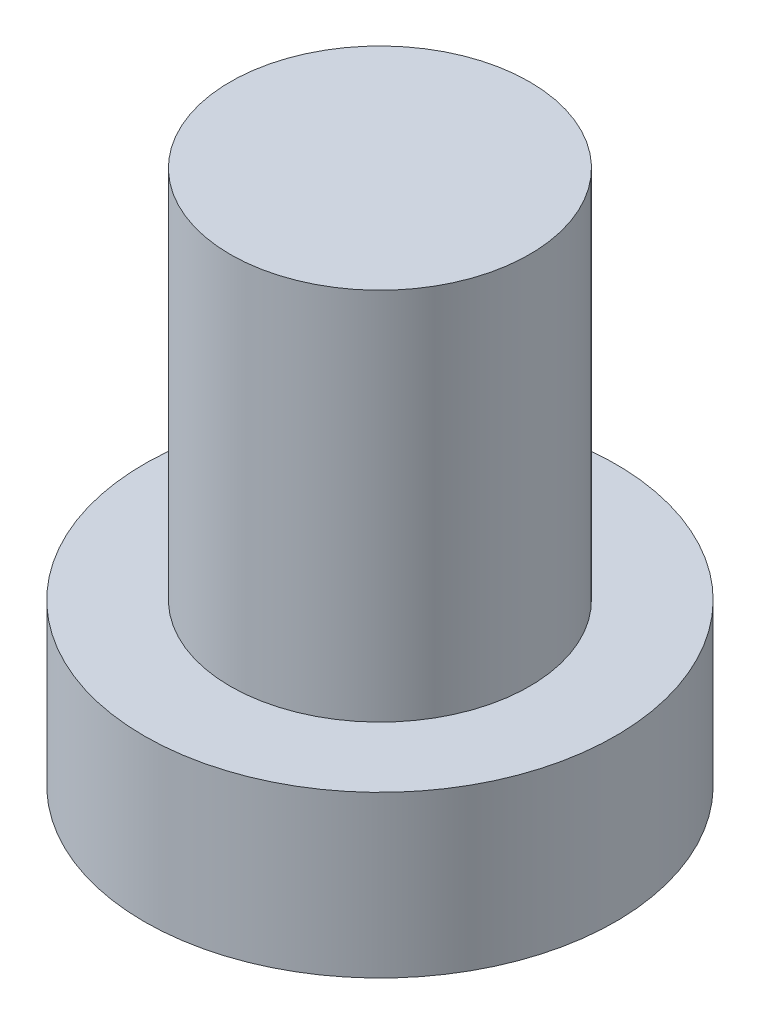
ISO-10303-21;
HEADER;
FILE_DESCRIPTION(('STEP AP214'),'2;1');
FILE_NAME('part.step','',(''),(''),'','','');
FILE_SCHEMA(('AUTOMOTIVE_DESIGN { 1 0 10303 214 1 1 1 1 }'));
ENDSEC;
DATA;
#1=APPLICATION_CONTEXT('core data for automotive mechanical design processes');
#2=APPLICATION_PROTOCOL_DEFINITION('international standard','automotive_design',2000,#1);
#3=PRODUCT_CONTEXT('',#1,'mechanical');
#4=PRODUCT('Part','Part','',(#3));
#5=PRODUCT_RELATED_PRODUCT_CATEGORY('part','',(#4));
#6=PRODUCT_DEFINITION_FORMATION('','',#4);
#7=PRODUCT_DEFINITION_CONTEXT('part definition',#1,'design');
#8=PRODUCT_DEFINITION('design','',#6,#7);
#9=PRODUCT_DEFINITION_SHAPE('','',#8);
#10=(LENGTH_UNIT() NAMED_UNIT(*) SI_UNIT(.MILLI.,.METRE.));
#11=(NAMED_UNIT(*) PLANE_ANGLE_UNIT() SI_UNIT($,.RADIAN.));
#12=(NAMED_UNIT(*) SI_UNIT($,.STERADIAN.) SOLID_ANGLE_UNIT());
#13=UNCERTAINTY_MEASURE_WITH_UNIT(LENGTH_MEASURE(1.E-05),#10,'distance_accuracy_value','');
#14=(GEOMETRIC_REPRESENTATION_CONTEXT(3) GLOBAL_UNCERTAINTY_ASSIGNED_CONTEXT((#13)) GLOBAL_UNIT_ASSIGNED_CONTEXT((#10,
#11,#12)) REPRESENTATION_CONTEXT('',''));
#15=CARTESIAN_POINT('',(0.,0.,0.));
#16=DIRECTION('',(0.,0.,1.));
#17=DIRECTION('',(1.,0.,0.));
#18=AXIS2_PLACEMENT_3D('',#15,#16,#17);
#19=CARTESIAN_POINT('',(0.,0.,0.));
#20=DIRECTION('',(0.,1.,0.));
#21=DIRECTION('',(0.,0.,1.));
#22=AXIS2_PLACEMENT_3D('',#19,#20,#21);
#23=PLANE('',#22);
#24=CARTESIAN_POINT('',(0.,0.,0.));
#25=DIRECTION('',(0.,1.,0.));
#26=DIRECTION('',(0.,0.,1.));
#27=AXIS2_PLACEMENT_3D('',#24,#25,#26);
#28=CIRCLE('',#27,3.15);
#29=CARTESIAN_POINT('',(0.,0.,3.15));
#30=VERTEX_POINT('',#29);
#31=EDGE_CURVE('E39',#30,#30,#28,.T.);
#32=ORIENTED_EDGE('',*,*,#31,.F.);
#33=EDGE_LOOP('',(#32));
#34=FACE_BOUND('',#33,.T.);
#35=CARTESIAN_POINT('',(1.,0.,1.));
#36=DIRECTION('',(0.,1.,0.));
#37=DIRECTION('',(0.,0.,-1.));
#38=AXIS2_PLACEMENT_3D('',#35,#36,#37);
#39=CIRCLE('',#38,0.5);
#40=CARTESIAN_POINT('',(1.,0.,0.5));
#41=VERTEX_POINT('',#40);
#42=CARTESIAN_POINT('',(0.5,0.,1.));
#43=VERTEX_POINT('',#42);
#44=EDGE_CURVE('E186',#41,#43,#39,.T.);
#45=ORIENTED_EDGE('',*,*,#44,.F.);
#46=DIRECTION('',(-1.,0.,0.));
#47=VECTOR('',#46,1.);
#48=CARTESIAN_POINT('',(1.,0.,0.5));
#49=LINE('',#48,#47);
#50=CARTESIAN_POINT('',(2.,0.,0.5));
#51=VERTEX_POINT('',#50);
#52=EDGE_CURVE('E52',#51,#41,#49,.T.);
#53=ORIENTED_EDGE('',*,*,#52,.F.);
#54=DIRECTION('',(0.,0.,1.));
#55=VECTOR('',#54,1.);
#56=CARTESIAN_POINT('',(2.,0.,-0.5));
#57=LINE('',#56,#55);
#58=CARTESIAN_POINT('',(2.,0.,-0.5));
#59=VERTEX_POINT('',#58);
#60=EDGE_CURVE('E225',#59,#51,#57,.T.);
#61=ORIENTED_EDGE('',*,*,#60,.F.);
#62=DIRECTION('',(1.,0.,0.));
#63=VECTOR('',#62,1.);
#64=CARTESIAN_POINT('',(1.,0.,-0.5));
#65=LINE('',#64,#63);
#66=CARTESIAN_POINT('',(1.,0.,-0.5));
#67=VERTEX_POINT('',#66);
#68=EDGE_CURVE('E223',#67,#59,#65,.T.);
#69=ORIENTED_EDGE('',*,*,#68,.F.);
#70=CARTESIAN_POINT('',(1.,0.,-1.));
#71=DIRECTION('',(0.,1.,0.));
#72=DIRECTION('',(0.,0.,-1.));
#73=AXIS2_PLACEMENT_3D('',#70,#71,#72);
#74=CIRCLE('',#73,0.5);
#75=CARTESIAN_POINT('',(0.500000000000001,0.,-1.));
#76=VERTEX_POINT('',#75);
#77=EDGE_CURVE('E160',#76,#67,#74,.T.);
#78=ORIENTED_EDGE('',*,*,#77,.F.);
#79=DIRECTION('',(0.,0.,1.));
#80=VECTOR('',#79,1.);
#81=CARTESIAN_POINT('',(0.500000000000001,0.,-2.));
#82=LINE('',#81,#80);
#83=CARTESIAN_POINT('',(0.500000000000001,0.,-2.));
#84=VERTEX_POINT('',#83);
#85=EDGE_CURVE('E219',#84,#76,#82,.T.);
#86=ORIENTED_EDGE('',*,*,#85,.F.);
#87=DIRECTION('',(1.,0.,0.));
#88=VECTOR('',#87,1.);
#89=CARTESIAN_POINT('',(-0.5,0.,-2.));
#90=LINE('',#89,#88);
#91=CARTESIAN_POINT('',(-0.5,0.,-2.));
#92=VERTEX_POINT('',#91);
#93=EDGE_CURVE('E216',#92,#84,#90,.T.);
#94=ORIENTED_EDGE('',*,*,#93,.F.);
#95=DIRECTION('',(0.,0.,-1.));
#96=VECTOR('',#95,1.);
#97=CARTESIAN_POINT('',(-0.5,0.,-2.));
#98=LINE('',#97,#96);
#99=CARTESIAN_POINT('',(-0.5,0.,-1.));
#100=VERTEX_POINT('',#99);
#101=EDGE_CURVE('E213',#100,#92,#98,.T.);
#102=ORIENTED_EDGE('',*,*,#101,.F.);
#103=CARTESIAN_POINT('',(-1.,0.,-1.));
#104=DIRECTION('',(0.,1.,0.));
#105=DIRECTION('',(0.,0.,-1.));
#106=AXIS2_PLACEMENT_3D('',#103,#104,#105);
#107=CIRCLE('',#106,0.5);
#108=CARTESIAN_POINT('',(-1.,0.,-0.5));
#109=VERTEX_POINT('',#108);
#110=EDGE_CURVE('E210',#109,#100,#107,.T.);
#111=ORIENTED_EDGE('',*,*,#110,.F.);
#112=DIRECTION('',(1.,0.,0.));
#113=VECTOR('',#112,1.);
#114=CARTESIAN_POINT('',(-2.,0.,-0.5));
#115=LINE('',#114,#113);
#116=CARTESIAN_POINT('',(-2.,0.,-0.5));
#117=VERTEX_POINT('',#116);
#118=EDGE_CURVE('E207',#117,#109,#115,.T.);
#119=ORIENTED_EDGE('',*,*,#118,.F.);
#120=DIRECTION('',(0.,0.,-1.));
#121=VECTOR('',#120,1.);
#122=CARTESIAN_POINT('',(-2.,0.,-0.5));
#123=LINE('',#122,#121);
#124=CARTESIAN_POINT('',(-2.,0.,0.5));
#125=VERTEX_POINT('',#124);
#126=EDGE_CURVE('E204',#125,#117,#123,.T.);
#127=ORIENTED_EDGE('',*,*,#126,.F.);
#128=DIRECTION('',(-1.,0.,0.));
#129=VECTOR('',#128,1.);
#130=CARTESIAN_POINT('',(-2.,0.,0.5));
#131=LINE('',#130,#129);
#132=CARTESIAN_POINT('',(-1.,0.,0.5));
#133=VERTEX_POINT('',#132);
#134=EDGE_CURVE('E201',#133,#125,#131,.T.);
#135=ORIENTED_EDGE('',*,*,#134,.F.);
#136=CARTESIAN_POINT('',(-1.,0.,1.));
#137=DIRECTION('',(0.,1.,0.));
#138=DIRECTION('',(0.,0.,1.));
#139=AXIS2_PLACEMENT_3D('',#136,#137,#138);
#140=CIRCLE('',#139,0.5);
#141=CARTESIAN_POINT('',(-0.5,0.,1.));
#142=VERTEX_POINT('',#141);
#143=EDGE_CURVE('E198',#142,#133,#140,.T.);
#144=ORIENTED_EDGE('',*,*,#143,.F.);
#145=DIRECTION('',(0.,0.,-1.));
#146=VECTOR('',#145,1.);
#147=CARTESIAN_POINT('',(-0.5,0.,1.));
#148=LINE('',#147,#146);
#149=CARTESIAN_POINT('',(-0.5,0.,2.));
#150=VERTEX_POINT('',#149);
#151=EDGE_CURVE('E195',#150,#142,#148,.T.);
#152=ORIENTED_EDGE('',*,*,#151,.F.);
#153=DIRECTION('',(-1.,0.,0.));
#154=VECTOR('',#153,1.);
#155=CARTESIAN_POINT('',(-0.5,0.,2.));
#156=LINE('',#155,#154);
#157=CARTESIAN_POINT('',(0.500000000000001,0.,2.));
#158=VERTEX_POINT('',#157);
#159=EDGE_CURVE('E192',#158,#150,#156,.T.);
#160=ORIENTED_EDGE('',*,*,#159,.F.);
#161=DIRECTION('',(0.,0.,1.));
#162=VECTOR('',#161,1.);
#163=CARTESIAN_POINT('',(0.5,0.,1.));
#164=LINE('',#163,#162);
#165=EDGE_CURVE('E189',#43,#158,#164,.T.);
#166=ORIENTED_EDGE('',*,*,#165,.F.);
#167=EDGE_LOOP('',(#45,#53,#61,#69,#78,#86,#94,#102,#111,#119,#127,#135,#144,#152,#160,#166));
#168=FACE_BOUND('',#167,.T.);
#169=ADVANCED_FACE('F35',(#34,#168),#23,.F.);
#170=CARTESIAN_POINT('',(0.,2.15,0.));
#171=DIRECTION('',(0.,-1.,0.));
#172=DIRECTION('',(0.,0.,-1.));
#173=AXIS2_PLACEMENT_3D('',#170,#171,#172);
#174=CYLINDRICAL_SURFACE('',#173,3.15);
#175=CARTESIAN_POINT('',(0.,2.15,0.));
#176=DIRECTION('',(0.,1.,0.));
#177=DIRECTION('',(0.,0.,1.));
#178=AXIS2_PLACEMENT_3D('',#175,#176,#177);
#179=CIRCLE('',#178,3.15);
#180=CARTESIAN_POINT('',(0.,2.15,3.15));
#181=VERTEX_POINT('',#180);
#182=EDGE_CURVE('E44',#181,#181,#179,.T.);
#183=ORIENTED_EDGE('',*,*,#182,.F.);
#184=EDGE_LOOP('',(#183));
#185=FACE_BOUND('',#184,.T.);
#186=ORIENTED_EDGE('',*,*,#31,.T.);
#187=EDGE_LOOP('',(#186));
#188=FACE_BOUND('',#187,.T.);
#189=ADVANCED_FACE('F37',(#185,#188),#174,.T.);
#190=CARTESIAN_POINT('',(0.,2.15,0.));
#191=DIRECTION('',(0.,1.,0.));
#192=DIRECTION('',(0.,0.,1.));
#193=AXIS2_PLACEMENT_3D('',#190,#191,#192);
#194=PLANE('',#193);
#195=CARTESIAN_POINT('',(0.,2.15,0.));
#196=DIRECTION('',(0.,1.,0.));
#197=DIRECTION('',(0.,0.,1.));
#198=AXIS2_PLACEMENT_3D('',#195,#196,#197);
#199=CIRCLE('',#198,2.);
#200=CARTESIAN_POINT('',(0.,2.15,2.));
#201=VERTEX_POINT('',#200);
#202=EDGE_CURVE('E11',#201,#201,#199,.T.);
#203=ORIENTED_EDGE('',*,*,#202,.F.);
#204=EDGE_LOOP('',(#203));
#205=FACE_BOUND('',#204,.T.);
#206=ORIENTED_EDGE('',*,*,#182,.T.);
#207=EDGE_LOOP('',(#206));
#208=FACE_BOUND('',#207,.T.);
#209=ADVANCED_FACE('F374',(#205,#208),#194,.T.);
#210=CARTESIAN_POINT('',(0.,7.15,0.));
#211=DIRECTION('',(0.,-1.,0.));
#212=DIRECTION('',(0.,0.,-1.));
#213=AXIS2_PLACEMENT_3D('',#210,#211,#212);
#214=CYLINDRICAL_SURFACE('',#213,2.);
#215=CARTESIAN_POINT('',(0.,7.15,0.));
#216=DIRECTION('',(0.,1.,0.));
#217=DIRECTION('',(0.,0.,1.));
#218=AXIS2_PLACEMENT_3D('',#215,#216,#217);
#219=CIRCLE('',#218,2.);
#220=CARTESIAN_POINT('',(0.,7.15,2.));
#221=VERTEX_POINT('',#220);
#222=EDGE_CURVE('E229',#221,#221,#219,.T.);
#223=ORIENTED_EDGE('',*,*,#222,.F.);
#224=EDGE_LOOP('',(#223));
#225=FACE_BOUND('',#224,.T.);
#226=ORIENTED_EDGE('',*,*,#202,.T.);
#227=EDGE_LOOP('',(#226));
#228=FACE_BOUND('',#227,.T.);
#229=ADVANCED_FACE('F370',(#225,#228),#214,.T.);
#230=CARTESIAN_POINT('',(0.,7.15,0.));
#231=DIRECTION('',(0.,1.,0.));
#232=DIRECTION('',(0.,0.,1.));
#233=AXIS2_PLACEMENT_3D('',#230,#231,#232);
#234=PLANE('',#233);
#235=ORIENTED_EDGE('',*,*,#222,.T.);
#236=EDGE_LOOP('',(#235));
#237=FACE_BOUND('',#236,.T.);
#238=ADVANCED_FACE('F320',(#237),#234,.T.);
#239=CARTESIAN_POINT('',(1.,1.5,0.5));
#240=DIRECTION('',(0.,0.,1.));
#241=DIRECTION('',(1.,0.,0.));
#242=AXIS2_PLACEMENT_3D('',#239,#240,#241);
#243=PLANE('',#242);
#244=ORIENTED_EDGE('',*,*,#52,.T.);
#245=DIRECTION('',(0.,-1.,0.));
#246=VECTOR('',#245,1.);
#247=CARTESIAN_POINT('',(1.,1.5,0.5));
#248=LINE('',#247,#246);
#249=CARTESIAN_POINT('',(1.,1.5,0.5));
#250=VERTEX_POINT('',#249);
#251=EDGE_CURVE('E112',#250,#41,#248,.T.);
#252=ORIENTED_EDGE('',*,*,#251,.F.);
#253=DIRECTION('',(-1.,0.,0.));
#254=VECTOR('',#253,1.);
#255=CARTESIAN_POINT('',(1.,1.5,0.5));
#256=LINE('',#255,#254);
#257=CARTESIAN_POINT('',(2.,1.5,0.5));
#258=VERTEX_POINT('',#257);
#259=EDGE_CURVE('E227',#258,#250,#256,.T.);
#260=ORIENTED_EDGE('',*,*,#259,.F.);
#261=DIRECTION('',(0.,-1.,0.));
#262=VECTOR('',#261,1.);
#263=CARTESIAN_POINT('',(2.,1.5,0.5));
#264=LINE('',#263,#262);
#265=EDGE_CURVE('E60',#258,#51,#264,.T.);
#266=ORIENTED_EDGE('',*,*,#265,.T.);
#267=EDGE_LOOP('',(#244,#252,#260,#266));
#268=FACE_BOUND('',#267,.T.);
#269=ADVANCED_FACE('F313',(#268),#243,.F.);
#270=CARTESIAN_POINT('',(2.,1.5,-0.5));
#271=DIRECTION('',(1.,0.,0.));
#272=DIRECTION('',(0.,0.,-1.));
#273=AXIS2_PLACEMENT_3D('',#270,#271,#272);
#274=PLANE('',#273);
#275=ORIENTED_EDGE('',*,*,#60,.T.);
#276=ORIENTED_EDGE('',*,*,#265,.F.);
#277=DIRECTION('',(0.,0.,1.));
#278=VECTOR('',#277,1.);
#279=CARTESIAN_POINT('',(2.,1.5,-0.5));
#280=LINE('',#279,#278);
#281=CARTESIAN_POINT('',(2.,1.5,-0.5));
#282=VERTEX_POINT('',#281);
#283=EDGE_CURVE('E172',#282,#258,#280,.T.);
#284=ORIENTED_EDGE('',*,*,#283,.F.);
#285=DIRECTION('',(0.,-1.,0.));
#286=VECTOR('',#285,1.);
#287=CARTESIAN_POINT('',(2.,1.5,-0.5));
#288=LINE('',#287,#286);
#289=EDGE_CURVE('E164',#282,#59,#288,.T.);
#290=ORIENTED_EDGE('',*,*,#289,.T.);
#291=EDGE_LOOP('',(#275,#276,#284,#290));
#292=FACE_BOUND('',#291,.T.);
#293=ADVANCED_FACE('F311',(#292),#274,.F.);
#294=CARTESIAN_POINT('',(1.,1.5,-0.5));
#295=DIRECTION('',(0.,0.,-1.));
#296=DIRECTION('',(-1.,0.,0.));
#297=AXIS2_PLACEMENT_3D('',#294,#295,#296);
#298=PLANE('',#297);
#299=ORIENTED_EDGE('',*,*,#68,.T.);
#300=ORIENTED_EDGE('',*,*,#289,.F.);
#301=DIRECTION('',(1.,0.,0.));
#302=VECTOR('',#301,1.);
#303=CARTESIAN_POINT('',(1.,1.5,-0.5));
#304=LINE('',#303,#302);
#305=CARTESIAN_POINT('',(1.,1.5,-0.5));
#306=VERTEX_POINT('',#305);
#307=EDGE_CURVE('E168',#306,#282,#304,.T.);
#308=ORIENTED_EDGE('',*,*,#307,.F.);
#309=DIRECTION('',(0.,-1.,0.));
#310=VECTOR('',#309,1.);
#311=CARTESIAN_POINT('',(1.,1.5,-0.5));
#312=LINE('',#311,#310);
#313=EDGE_CURVE('E153',#306,#67,#312,.T.);
#314=ORIENTED_EDGE('',*,*,#313,.T.);
#315=EDGE_LOOP('',(#299,#300,#308,#314));
#316=FACE_BOUND('',#315,.T.);
#317=ADVANCED_FACE('F169',(#316),#298,.F.);
#318=CARTESIAN_POINT('',(1.,1.5,-1.));
#319=DIRECTION('',(0.,-1.,0.));
#320=DIRECTION('',(0.,0.,-1.));
#321=AXIS2_PLACEMENT_3D('',#318,#319,#320);
#322=CYLINDRICAL_SURFACE('',#321,0.5);
#323=ORIENTED_EDGE('',*,*,#77,.T.);
#324=ORIENTED_EDGE('',*,*,#313,.F.);
#325=CARTESIAN_POINT('',(1.,1.5,-1.));
#326=DIRECTION('',(0.,1.,0.));
#327=DIRECTION('',(0.,0.,-1.));
#328=AXIS2_PLACEMENT_3D('',#325,#326,#327);
#329=CIRCLE('',#328,0.5);
#330=CARTESIAN_POINT('',(0.500000000000001,1.5,-1.));
#331=VERTEX_POINT('',#330);
#332=EDGE_CURVE('E157',#331,#306,#329,.T.);
#333=ORIENTED_EDGE('',*,*,#332,.F.);
#334=DIRECTION('',(0.,-1.,0.));
#335=VECTOR('',#334,1.);
#336=CARTESIAN_POINT('',(0.500000000000001,1.5,-1.));
#337=LINE('',#336,#335);
#338=EDGE_CURVE('E165',#331,#76,#337,.T.);
#339=ORIENTED_EDGE('',*,*,#338,.T.);
#340=EDGE_LOOP('',(#323,#324,#333,#339));
#341=FACE_BOUND('',#340,.T.);
#342=ADVANCED_FACE('F155',(#341),#322,.T.);
#343=CARTESIAN_POINT('',(0.500000000000001,1.5,-2.));
#344=DIRECTION('',(1.,0.,0.));
#345=DIRECTION('',(0.,0.,-1.));
#346=AXIS2_PLACEMENT_3D('',#343,#344,#345);
#347=PLANE('',#346);
#348=ORIENTED_EDGE('',*,*,#85,.T.);
#349=ORIENTED_EDGE('',*,*,#338,.F.);
#350=DIRECTION('',(0.,0.,1.));
#351=VECTOR('',#350,1.);
#352=CARTESIAN_POINT('',(0.500000000000001,1.5,-2.));
#353=LINE('',#352,#351);
#354=CARTESIAN_POINT('',(0.500000000000001,1.5,-2.));
#355=VERTEX_POINT('',#354);
#356=EDGE_CURVE('E178',#355,#331,#353,.T.);
#357=ORIENTED_EDGE('',*,*,#356,.F.);
#358=DIRECTION('',(0.,-1.,0.));
#359=VECTOR('',#358,1.);
#360=CARTESIAN_POINT('',(0.500000000000001,1.5,-2.));
#361=LINE('',#360,#359);
#362=EDGE_CURVE('E232',#355,#84,#361,.T.);
#363=ORIENTED_EDGE('',*,*,#362,.T.);
#364=EDGE_LOOP('',(#348,#349,#357,#363));
#365=FACE_BOUND('',#364,.T.);
#366=ADVANCED_FACE('F310',(#365),#347,.F.);
#367=CARTESIAN_POINT('',(-0.5,1.5,-2.));
#368=DIRECTION('',(0.,0.,-1.));
#369=DIRECTION('',(-1.,0.,0.));
#370=AXIS2_PLACEMENT_3D('',#367,#368,#369);
#371=PLANE('',#370);
#372=ORIENTED_EDGE('',*,*,#93,.T.);
#373=ORIENTED_EDGE('',*,*,#362,.F.);
#374=DIRECTION('',(1.,0.,0.));
#375=VECTOR('',#374,1.);
#376=CARTESIAN_POINT('',(-0.5,1.5,-2.));
#377=LINE('',#376,#375);
#378=CARTESIAN_POINT('',(-0.5,1.5,-2.));
#379=VERTEX_POINT('',#378);
#380=EDGE_CURVE('E180',#379,#355,#377,.T.);
#381=ORIENTED_EDGE('',*,*,#380,.F.);
#382=DIRECTION('',(0.,-1.,0.));
#383=VECTOR('',#382,1.);
#384=CARTESIAN_POINT('',(-0.5,1.5,-2.));
#385=LINE('',#384,#383);
#386=EDGE_CURVE('E234',#379,#92,#385,.T.);
#387=ORIENTED_EDGE('',*,*,#386,.T.);
#388=EDGE_LOOP('',(#372,#373,#381,#387));
#389=FACE_BOUND('',#388,.T.);
#390=ADVANCED_FACE('F306',(#389),#371,.F.);
#391=CARTESIAN_POINT('',(-0.5,1.5,-2.));
#392=DIRECTION('',(-1.,0.,0.));
#393=DIRECTION('',(0.,0.,1.));
#394=AXIS2_PLACEMENT_3D('',#391,#392,#393);
#395=PLANE('',#394);
#396=ORIENTED_EDGE('',*,*,#101,.T.);
#397=ORIENTED_EDGE('',*,*,#386,.F.);
#398=DIRECTION('',(0.,0.,-1.));
#399=VECTOR('',#398,1.);
#400=CARTESIAN_POINT('',(-0.5,1.5,-2.));
#401=LINE('',#400,#399);
#402=CARTESIAN_POINT('',(-0.5,1.5,-1.));
#403=VERTEX_POINT('',#402);
#404=EDGE_CURVE('E301',#403,#379,#401,.T.);
#405=ORIENTED_EDGE('',*,*,#404,.F.);
#406=DIRECTION('',(0.,-1.,0.));
#407=VECTOR('',#406,1.);
#408=CARTESIAN_POINT('',(-0.5,1.5,-1.));
#409=LINE('',#408,#407);
#410=EDGE_CURVE('E236',#403,#100,#409,.T.);
#411=ORIENTED_EDGE('',*,*,#410,.T.);
#412=EDGE_LOOP('',(#396,#397,#405,#411));
#413=FACE_BOUND('',#412,.T.);
#414=ADVANCED_FACE('F330',(#413),#395,.F.);
#415=CARTESIAN_POINT('',(-1.,1.5,-1.));
#416=DIRECTION('',(0.,-1.,0.));
#417=DIRECTION('',(0.,0.,-1.));
#418=AXIS2_PLACEMENT_3D('',#415,#416,#417);
#419=CYLINDRICAL_SURFACE('',#418,0.5);
#420=ORIENTED_EDGE('',*,*,#110,.T.);
#421=ORIENTED_EDGE('',*,*,#410,.F.);
#422=CARTESIAN_POINT('',(-1.,1.5,-1.));
#423=DIRECTION('',(0.,1.,0.));
#424=DIRECTION('',(0.,0.,-1.));
#425=AXIS2_PLACEMENT_3D('',#422,#423,#424);
#426=CIRCLE('',#425,0.5);
#427=CARTESIAN_POINT('',(-1.,1.5,-0.5));
#428=VERTEX_POINT('',#427);
#429=EDGE_CURVE('E298',#428,#403,#426,.T.);
#430=ORIENTED_EDGE('',*,*,#429,.F.);
#431=DIRECTION('',(0.,-1.,0.));
#432=VECTOR('',#431,1.);
#433=CARTESIAN_POINT('',(-1.,1.5,-0.5));
#434=LINE('',#433,#432);
#435=EDGE_CURVE('E238',#428,#109,#434,.T.);
#436=ORIENTED_EDGE('',*,*,#435,.T.);
#437=EDGE_LOOP('',(#420,#421,#430,#436));
#438=FACE_BOUND('',#437,.T.);
#439=ADVANCED_FACE('F333',(#438),#419,.T.);
#440=CARTESIAN_POINT('',(-2.,1.5,-0.5));
#441=DIRECTION('',(0.,0.,-1.));
#442=DIRECTION('',(-1.,0.,0.));
#443=AXIS2_PLACEMENT_3D('',#440,#441,#442);
#444=PLANE('',#443);
#445=ORIENTED_EDGE('',*,*,#118,.T.);
#446=ORIENTED_EDGE('',*,*,#435,.F.);
#447=DIRECTION('',(1.,0.,0.));
#448=VECTOR('',#447,1.);
#449=CARTESIAN_POINT('',(-2.,1.5,-0.5));
#450=LINE('',#449,#448);
#451=CARTESIAN_POINT('',(-2.,1.5,-0.5));
#452=VERTEX_POINT('',#451);
#453=EDGE_CURVE('E295',#452,#428,#450,.T.);
#454=ORIENTED_EDGE('',*,*,#453,.F.);
#455=DIRECTION('',(0.,-1.,0.));
#456=VECTOR('',#455,1.);
#457=CARTESIAN_POINT('',(-2.,1.5,-0.5));
#458=LINE('',#457,#456);
#459=EDGE_CURVE('E240',#452,#117,#458,.T.);
#460=ORIENTED_EDGE('',*,*,#459,.T.);
#461=EDGE_LOOP('',(#445,#446,#454,#460));
#462=FACE_BOUND('',#461,.T.);
#463=ADVANCED_FACE('F337',(#462),#444,.F.);
#464=CARTESIAN_POINT('',(-2.,1.5,-0.5));
#465=DIRECTION('',(-1.,0.,0.));
#466=DIRECTION('',(0.,0.,1.));
#467=AXIS2_PLACEMENT_3D('',#464,#465,#466);
#468=PLANE('',#467);
#469=ORIENTED_EDGE('',*,*,#126,.T.);
#470=ORIENTED_EDGE('',*,*,#459,.F.);
#471=DIRECTION('',(0.,0.,-1.));
#472=VECTOR('',#471,1.);
#473=CARTESIAN_POINT('',(-2.,1.5,-0.5));
#474=LINE('',#473,#472);
#475=CARTESIAN_POINT('',(-2.,1.5,0.5));
#476=VERTEX_POINT('',#475);
#477=EDGE_CURVE('E292',#476,#452,#474,.T.);
#478=ORIENTED_EDGE('',*,*,#477,.F.);
#479=DIRECTION('',(0.,-1.,0.));
#480=VECTOR('',#479,1.);
#481=CARTESIAN_POINT('',(-2.,1.5,0.5));
#482=LINE('',#481,#480);
#483=EDGE_CURVE('E242',#476,#125,#482,.T.);
#484=ORIENTED_EDGE('',*,*,#483,.T.);
#485=EDGE_LOOP('',(#469,#470,#478,#484));
#486=FACE_BOUND('',#485,.T.);
#487=ADVANCED_FACE('F341',(#486),#468,.F.);
#488=CARTESIAN_POINT('',(-2.,1.5,0.5));
#489=DIRECTION('',(0.,0.,1.));
#490=DIRECTION('',(1.,0.,0.));
#491=AXIS2_PLACEMENT_3D('',#488,#489,#490);
#492=PLANE('',#491);
#493=ORIENTED_EDGE('',*,*,#134,.T.);
#494=ORIENTED_EDGE('',*,*,#483,.F.);
#495=DIRECTION('',(-1.,0.,0.));
#496=VECTOR('',#495,1.);
#497=CARTESIAN_POINT('',(-2.,1.5,0.5));
#498=LINE('',#497,#496);
#499=CARTESIAN_POINT('',(-1.,1.5,0.5));
#500=VERTEX_POINT('',#499);
#501=EDGE_CURVE('E289',#500,#476,#498,.T.);
#502=ORIENTED_EDGE('',*,*,#501,.F.);
#503=DIRECTION('',(0.,-1.,0.));
#504=VECTOR('',#503,1.);
#505=CARTESIAN_POINT('',(-1.,1.5,0.5));
#506=LINE('',#505,#504);
#507=EDGE_CURVE('E244',#500,#133,#506,.T.);
#508=ORIENTED_EDGE('',*,*,#507,.T.);
#509=EDGE_LOOP('',(#493,#494,#502,#508));
#510=FACE_BOUND('',#509,.T.);
#511=ADVANCED_FACE('F345',(#510),#492,.F.);
#512=CARTESIAN_POINT('',(-1.,1.5,1.));
#513=DIRECTION('',(0.,-1.,0.));
#514=DIRECTION('',(0.,0.,-1.));
#515=AXIS2_PLACEMENT_3D('',#512,#513,#514);
#516=CYLINDRICAL_SURFACE('',#515,0.5);
#517=ORIENTED_EDGE('',*,*,#143,.T.);
#518=ORIENTED_EDGE('',*,*,#507,.F.);
#519=CARTESIAN_POINT('',(-1.,1.5,1.));
#520=DIRECTION('',(0.,1.,0.));
#521=DIRECTION('',(0.,0.,1.));
#522=AXIS2_PLACEMENT_3D('',#519,#520,#521);
#523=CIRCLE('',#522,0.5);
#524=CARTESIAN_POINT('',(-0.5,1.5,1.));
#525=VERTEX_POINT('',#524);
#526=EDGE_CURVE('E286',#525,#500,#523,.T.);
#527=ORIENTED_EDGE('',*,*,#526,.F.);
#528=DIRECTION('',(0.,-1.,0.));
#529=VECTOR('',#528,1.);
#530=CARTESIAN_POINT('',(-0.5,1.5,1.));
#531=LINE('',#530,#529);
#532=EDGE_CURVE('E246',#525,#142,#531,.T.);
#533=ORIENTED_EDGE('',*,*,#532,.T.);
#534=EDGE_LOOP('',(#517,#518,#527,#533));
#535=FACE_BOUND('',#534,.T.);
#536=ADVANCED_FACE('F349',(#535),#516,.T.);
#537=CARTESIAN_POINT('',(-0.5,1.5,1.));
#538=DIRECTION('',(-1.,0.,0.));
#539=DIRECTION('',(0.,0.,1.));
#540=AXIS2_PLACEMENT_3D('',#537,#538,#539);
#541=PLANE('',#540);
#542=ORIENTED_EDGE('',*,*,#151,.T.);
#543=ORIENTED_EDGE('',*,*,#532,.F.);
#544=DIRECTION('',(0.,0.,-1.));
#545=VECTOR('',#544,1.);
#546=CARTESIAN_POINT('',(-0.5,1.5,1.));
#547=LINE('',#546,#545);
#548=CARTESIAN_POINT('',(-0.5,1.5,2.));
#549=VERTEX_POINT('',#548);
#550=EDGE_CURVE('E283',#549,#525,#547,.T.);
#551=ORIENTED_EDGE('',*,*,#550,.F.);
#552=DIRECTION('',(0.,-1.,0.));
#553=VECTOR('',#552,1.);
#554=CARTESIAN_POINT('',(-0.5,1.5,2.));
#555=LINE('',#554,#553);
#556=EDGE_CURVE('E248',#549,#150,#555,.T.);
#557=ORIENTED_EDGE('',*,*,#556,.T.);
#558=EDGE_LOOP('',(#542,#543,#551,#557));
#559=FACE_BOUND('',#558,.T.);
#560=ADVANCED_FACE('F353',(#559),#541,.F.);
#561=CARTESIAN_POINT('',(-0.5,1.5,2.));
#562=DIRECTION('',(0.,0.,1.));
#563=DIRECTION('',(1.,0.,0.));
#564=AXIS2_PLACEMENT_3D('',#561,#562,#563);
#565=PLANE('',#564);
#566=ORIENTED_EDGE('',*,*,#159,.T.);
#567=ORIENTED_EDGE('',*,*,#556,.F.);
#568=DIRECTION('',(-1.,0.,0.));
#569=VECTOR('',#568,1.);
#570=CARTESIAN_POINT('',(-0.5,1.5,2.));
#571=LINE('',#570,#569);
#572=CARTESIAN_POINT('',(0.500000000000001,1.5,2.));
#573=VERTEX_POINT('',#572);
#574=EDGE_CURVE('E280',#573,#549,#571,.T.);
#575=ORIENTED_EDGE('',*,*,#574,.F.);
#576=DIRECTION('',(0.,-1.,0.));
#577=VECTOR('',#576,1.);
#578=CARTESIAN_POINT('',(0.500000000000001,1.5,2.));
#579=LINE('',#578,#577);
#580=EDGE_CURVE('E250',#573,#158,#579,.T.);
#581=ORIENTED_EDGE('',*,*,#580,.T.);
#582=EDGE_LOOP('',(#566,#567,#575,#581));
#583=FACE_BOUND('',#582,.T.);
#584=ADVANCED_FACE('F357',(#583),#565,.F.);
#585=CARTESIAN_POINT('',(0.5,1.5,1.));
#586=DIRECTION('',(1.,0.,0.));
#587=DIRECTION('',(0.,0.,-1.));
#588=AXIS2_PLACEMENT_3D('',#585,#586,#587);
#589=PLANE('',#588);
#590=ORIENTED_EDGE('',*,*,#165,.T.);
#591=ORIENTED_EDGE('',*,*,#580,.F.);
#592=DIRECTION('',(0.,0.,1.));
#593=VECTOR('',#592,1.);
#594=CARTESIAN_POINT('',(0.5,1.5,1.));
#595=LINE('',#594,#593);
#596=CARTESIAN_POINT('',(0.5,1.5,1.));
#597=VERTEX_POINT('',#596);
#598=EDGE_CURVE('E275',#597,#573,#595,.T.);
#599=ORIENTED_EDGE('',*,*,#598,.F.);
#600=DIRECTION('',(0.,-1.,0.));
#601=VECTOR('',#600,1.);
#602=CARTESIAN_POINT('',(0.5,1.5,1.));
#603=LINE('',#602,#601);
#604=EDGE_CURVE('E252',#597,#43,#603,.T.);
#605=ORIENTED_EDGE('',*,*,#604,.T.);
#606=EDGE_LOOP('',(#590,#591,#599,#605));
#607=FACE_BOUND('',#606,.T.);
#608=ADVANCED_FACE('F361',(#607),#589,.F.);
#609=CARTESIAN_POINT('',(1.,1.5,1.));
#610=DIRECTION('',(0.,-1.,0.));
#611=DIRECTION('',(0.,0.,-1.));
#612=AXIS2_PLACEMENT_3D('',#609,#610,#611);
#613=CYLINDRICAL_SURFACE('',#612,0.5);
#614=ORIENTED_EDGE('',*,*,#44,.T.);
#615=ORIENTED_EDGE('',*,*,#604,.F.);
#616=CARTESIAN_POINT('',(1.,1.5,1.));
#617=DIRECTION('',(0.,1.,0.));
#618=DIRECTION('',(0.,0.,-1.));
#619=AXIS2_PLACEMENT_3D('',#616,#617,#618);
#620=CIRCLE('',#619,0.5);
#621=EDGE_CURVE('E273',#250,#597,#620,.T.);
#622=ORIENTED_EDGE('',*,*,#621,.F.);
#623=ORIENTED_EDGE('',*,*,#251,.T.);
#624=EDGE_LOOP('',(#614,#615,#622,#623));
#625=FACE_BOUND('',#624,.T.);
#626=ADVANCED_FACE('F270',(#625),#613,.T.);
#627=CARTESIAN_POINT('',(1.,1.5,-1.));
#628=DIRECTION('',(0.,-1.,0.));
#629=DIRECTION('',(0.,0.,-1.));
#630=AXIS2_PLACEMENT_3D('',#627,#628,#629);
#631=PLANE('',#630);
#632=ORIENTED_EDGE('',*,*,#259,.T.);
#633=ORIENTED_EDGE('',*,*,#621,.T.);
#634=ORIENTED_EDGE('',*,*,#598,.T.);
#635=ORIENTED_EDGE('',*,*,#574,.T.);
#636=ORIENTED_EDGE('',*,*,#550,.T.);
#637=ORIENTED_EDGE('',*,*,#526,.T.);
#638=ORIENTED_EDGE('',*,*,#501,.T.);
#639=ORIENTED_EDGE('',*,*,#477,.T.);
#640=ORIENTED_EDGE('',*,*,#453,.T.);
#641=ORIENTED_EDGE('',*,*,#429,.T.);
#642=ORIENTED_EDGE('',*,*,#404,.T.);
#643=ORIENTED_EDGE('',*,*,#380,.T.);
#644=ORIENTED_EDGE('',*,*,#356,.T.);
#645=ORIENTED_EDGE('',*,*,#332,.T.);
#646=ORIENTED_EDGE('',*,*,#307,.T.);
#647=ORIENTED_EDGE('',*,*,#283,.T.);
#648=EDGE_LOOP('',(#632,#633,#634,#635,#636,#637,#638,#639,#640,#641,#642,#643,#644,#645,#646,#647));
#649=FACE_BOUND('',#648,.T.);
#650=ADVANCED_FACE('F175',(#649),#631,.T.);
#651=CLOSED_SHELL('',(#169,#189,#209,#229,#238,#269,#293,#317,#342,#366,#390,#414,#439,#463,
#487,#511,#536,#560,#584,#608,#626,#650));
#652=MANIFOLD_SOLID_BREP('B2',#651);
#653=ADVANCED_BREP_SHAPE_REPRESENTATION('',(#18,#652),#14);
#654=SHAPE_DEFINITION_REPRESENTATION(#9,#653);
ENDSEC;
END-ISO-10303-21;
